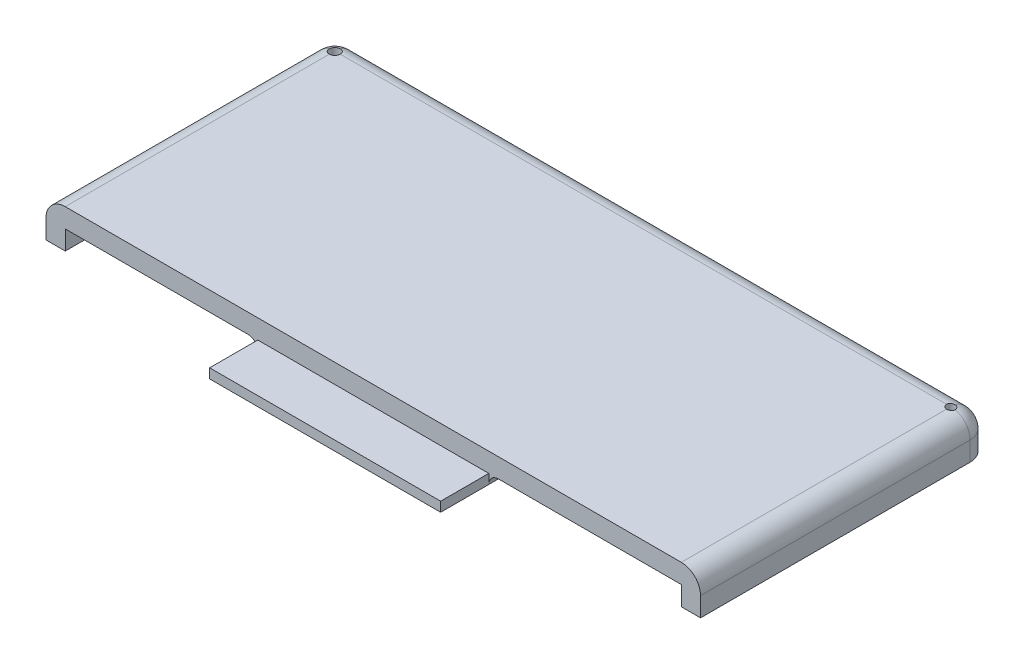
ISO-10303-21;
HEADER;
FILE_DESCRIPTION(('STEP AP214'),'2;1');
FILE_NAME('part.step','',(''),(''),'','','');
FILE_SCHEMA(('AUTOMOTIVE_DESIGN { 1 0 10303 214 1 1 1 1 }'));
ENDSEC;
DATA;
#1=APPLICATION_CONTEXT('core data for automotive mechanical design processes');
#2=APPLICATION_PROTOCOL_DEFINITION('international standard','automotive_design',2000,#1);
#3=PRODUCT_CONTEXT('',#1,'mechanical');
#4=PRODUCT('Part','Part','',(#3));
#5=PRODUCT_RELATED_PRODUCT_CATEGORY('part','',(#4));
#6=PRODUCT_DEFINITION_FORMATION('','',#4);
#7=PRODUCT_DEFINITION_CONTEXT('part definition',#1,'design');
#8=PRODUCT_DEFINITION('design','',#6,#7);
#9=PRODUCT_DEFINITION_SHAPE('','',#8);
#10=(LENGTH_UNIT() NAMED_UNIT(*) SI_UNIT(.MILLI.,.METRE.));
#11=(NAMED_UNIT(*) PLANE_ANGLE_UNIT() SI_UNIT($,.RADIAN.));
#12=(NAMED_UNIT(*) SI_UNIT($,.STERADIAN.) SOLID_ANGLE_UNIT());
#13=UNCERTAINTY_MEASURE_WITH_UNIT(LENGTH_MEASURE(1.E-05),#10,'distance_accuracy_value','');
#14=(GEOMETRIC_REPRESENTATION_CONTEXT(3) GLOBAL_UNCERTAINTY_ASSIGNED_CONTEXT((#13)) GLOBAL_UNIT_ASSIGNED_CONTEXT((#10,
#11,#12)) REPRESENTATION_CONTEXT('',''));
#15=CARTESIAN_POINT('',(0.,0.,0.));
#16=DIRECTION('',(0.,0.,1.));
#17=DIRECTION('',(1.,0.,0.));
#18=AXIS2_PLACEMENT_3D('',#15,#16,#17);
#19=CARTESIAN_POINT('',(85.,35.,75.));
#20=DIRECTION('',(0.,0.,-1.));
#21=DIRECTION('',(-1.,0.,0.));
#22=AXIS2_PLACEMENT_3D('',#19,#20,#21);
#23=PLANE('',#22);
#24=DIRECTION('',(-1.,0.,0.));
#25=VECTOR('',#24,1.);
#26=CARTESIAN_POINT('',(-30.,30.,75.));
#27=LINE('',#26,#25);
#28=CARTESIAN_POINT('',(30.,30.,75.));
#29=VERTEX_POINT('',#28);
#30=CARTESIAN_POINT('',(-30.,30.,75.));
#31=VERTEX_POINT('',#30);
#32=EDGE_CURVE('E220',#29,#31,#27,.T.);
#33=ORIENTED_EDGE('',*,*,#32,.F.);
#34=DIRECTION('',(0.,1.,0.));
#35=VECTOR('',#34,1.);
#36=CARTESIAN_POINT('',(30.,35.,75.));
#37=LINE('',#36,#35);
#38=CARTESIAN_POINT('',(30.,27.5,75.));
#39=VERTEX_POINT('',#38);
#40=EDGE_CURVE('E61',#39,#29,#37,.T.);
#41=ORIENTED_EDGE('',*,*,#40,.F.);
#42=CARTESIAN_POINT('',(32.5,27.5,75.));
#43=DIRECTION('',(0.,0.,-1.));
#44=DIRECTION('',(-1.,0.,0.));
#45=AXIS2_PLACEMENT_3D('',#42,#43,#44);
#46=CIRCLE('',#45,2.5);
#47=CARTESIAN_POINT('',(32.5,30.,75.));
#48=VERTEX_POINT('',#47);
#49=EDGE_CURVE('E11',#39,#48,#46,.T.);
#50=ORIENTED_EDGE('',*,*,#49,.T.);
#51=DIRECTION('',(-1.,0.,0.));
#52=VECTOR('',#51,1.);
#53=CARTESIAN_POINT('',(80.,30.,75.));
#54=LINE('',#53,#52);
#55=CARTESIAN_POINT('',(80.,30.,75.));
#56=VERTEX_POINT('',#55);
#57=EDGE_CURVE('E384',#56,#48,#54,.T.);
#58=ORIENTED_EDGE('',*,*,#57,.F.);
#59=DIRECTION('',(0.,-1.,0.));
#60=VECTOR('',#59,1.);
#61=CARTESIAN_POINT('',(80.,25.,75.));
#62=LINE('',#61,#60);
#63=CARTESIAN_POINT('',(80.,25.,75.));
#64=VERTEX_POINT('',#63);
#65=EDGE_CURVE('E403',#56,#64,#62,.T.);
#66=ORIENTED_EDGE('',*,*,#65,.T.);
#67=DIRECTION('',(-1.,0.,0.));
#68=VECTOR('',#67,1.);
#69=CARTESIAN_POINT('',(85.,25.,75.));
#70=LINE('',#69,#68);
#71=CARTESIAN_POINT('',(85.,25.,75.));
#72=VERTEX_POINT('',#71);
#73=EDGE_CURVE('E368',#72,#64,#70,.T.);
#74=ORIENTED_EDGE('',*,*,#73,.F.);
#75=DIRECTION('',(0.,-1.,0.));
#76=VECTOR('',#75,1.);
#77=CARTESIAN_POINT('',(85.,35.,75.));
#78=LINE('',#77,#76);
#79=CARTESIAN_POINT('',(85.,30.,75.));
#80=VERTEX_POINT('',#79);
#81=EDGE_CURVE('E375',#80,#72,#78,.T.);
#82=ORIENTED_EDGE('',*,*,#81,.F.);
#83=CARTESIAN_POINT('',(80.,30.,75.));
#84=DIRECTION('',(0.,0.,-1.));
#85=DIRECTION('',(-1.,0.,0.));
#86=AXIS2_PLACEMENT_3D('',#83,#84,#85);
#87=CIRCLE('',#86,5.);
#88=CARTESIAN_POINT('',(80.,35.,75.));
#89=VERTEX_POINT('',#88);
#90=EDGE_CURVE('E348',#80,#89,#87,.F.);
#91=ORIENTED_EDGE('',*,*,#90,.T.);
#92=DIRECTION('',(-1.,0.,0.));
#93=VECTOR('',#92,1.);
#94=CARTESIAN_POINT('',(85.,35.,75.));
#95=LINE('',#94,#93);
#96=CARTESIAN_POINT('',(-80.,35.,75.));
#97=VERTEX_POINT('',#96);
#98=EDGE_CURVE('E363',#89,#97,#95,.T.);
#99=ORIENTED_EDGE('',*,*,#98,.T.);
#100=CARTESIAN_POINT('',(-80.,30.,75.));
#101=DIRECTION('',(0.,0.,-1.));
#102=DIRECTION('',(-1.,0.,0.));
#103=AXIS2_PLACEMENT_3D('',#100,#101,#102);
#104=CIRCLE('',#103,5.);
#105=CARTESIAN_POINT('',(-85.,30.,75.));
#106=VERTEX_POINT('',#105);
#107=EDGE_CURVE('E360',#97,#106,#104,.F.);
#108=ORIENTED_EDGE('',*,*,#107,.T.);
#109=DIRECTION('',(0.,-1.,0.));
#110=VECTOR('',#109,1.);
#111=CARTESIAN_POINT('',(-85.,35.,75.));
#112=LINE('',#111,#110);
#113=CARTESIAN_POINT('',(-85.,25.,75.));
#114=VERTEX_POINT('',#113);
#115=EDGE_CURVE('E376',#106,#114,#112,.T.);
#116=ORIENTED_EDGE('',*,*,#115,.T.);
#117=CARTESIAN_POINT('',(-80.,25.,75.));
#118=VERTEX_POINT('',#117);
#119=EDGE_CURVE('E366',#118,#114,#70,.T.);
#120=ORIENTED_EDGE('',*,*,#119,.F.);
#121=DIRECTION('',(0.,-1.,0.));
#122=VECTOR('',#121,1.);
#123=CARTESIAN_POINT('',(-80.,25.,75.));
#124=LINE('',#123,#122);
#125=CARTESIAN_POINT('',(-80.,30.,75.));
#126=VERTEX_POINT('',#125);
#127=EDGE_CURVE('E396',#126,#118,#124,.T.);
#128=ORIENTED_EDGE('',*,*,#127,.F.);
#129=CARTESIAN_POINT('',(-32.5,30.,75.));
#130=VERTEX_POINT('',#129);
#131=EDGE_CURVE('E388',#130,#126,#54,.T.);
#132=ORIENTED_EDGE('',*,*,#131,.F.);
#133=CARTESIAN_POINT('',(-32.5,27.5,75.));
#134=DIRECTION('',(0.,0.,-1.));
#135=DIRECTION('',(-1.,0.,0.));
#136=AXIS2_PLACEMENT_3D('',#133,#134,#135);
#137=CIRCLE('',#136,2.5);
#138=CARTESIAN_POINT('',(-30.,27.5,75.));
#139=VERTEX_POINT('',#138);
#140=EDGE_CURVE('E48',#130,#139,#137,.T.);
#141=ORIENTED_EDGE('',*,*,#140,.T.);
#142=DIRECTION('',(0.,-1.,0.));
#143=VECTOR('',#142,1.);
#144=CARTESIAN_POINT('',(-30.,35.,75.));
#145=LINE('',#144,#143);
#146=EDGE_CURVE('E56',#31,#139,#145,.T.);
#147=ORIENTED_EDGE('',*,*,#146,.F.);
#148=EDGE_LOOP('',(#33,#41,#50,#58,#66,#74,#82,#91,#99,#108,#116,#120,#128,#132,#141,#147));
#149=FACE_BOUND('',#148,.T.);
#150=ADVANCED_FACE('F39',(#149),#23,.F.);
#151=CARTESIAN_POINT('',(80.,30.,4.99999999999996));
#152=DIRECTION('',(0.,1.,0.));
#153=DIRECTION('',(-1.,0.,0.));
#154=AXIS2_PLACEMENT_3D('',#151,#152,#153);
#155=PLANE('',#154);
#156=DIRECTION('',(1.,0.,0.));
#157=VECTOR('',#156,1.);
#158=CARTESIAN_POINT('',(-30.,30.,65.));
#159=LINE('',#158,#157);
#160=CARTESIAN_POINT('',(32.5,30.,65.));
#161=VERTEX_POINT('',#160);
#162=CARTESIAN_POINT('',(-32.5,30.,65.));
#163=VERTEX_POINT('',#162);
#164=EDGE_CURVE('E460',#161,#163,#159,.F.);
#165=ORIENTED_EDGE('',*,*,#164,.T.);
#166=DIRECTION('',(0.,0.,-1.));
#167=VECTOR('',#166,1.);
#168=CARTESIAN_POINT('',(-32.5,30.,75.));
#169=LINE('',#168,#167);
#170=EDGE_CURVE('E462',#163,#130,#169,.F.);
#171=ORIENTED_EDGE('',*,*,#170,.T.);
#172=ORIENTED_EDGE('',*,*,#131,.T.);
#173=DIRECTION('',(0.,0.,1.));
#174=VECTOR('',#173,1.);
#175=CARTESIAN_POINT('',(-80.,30.,4.99999999999996));
#176=LINE('',#175,#174);
#177=CARTESIAN_POINT('',(-80.,30.,9.99999999999997));
#178=VERTEX_POINT('',#177);
#179=EDGE_CURVE('E392',#178,#126,#176,.T.);
#180=ORIENTED_EDGE('',*,*,#179,.F.);
#181=CARTESIAN_POINT('',(-80.,30.,4.99999999999996));
#182=DIRECTION('',(0.,-1.,0.));
#183=DIRECTION('',(1.,0.,0.));
#184=AXIS2_PLACEMENT_3D('',#181,#182,#183);
#185=CIRCLE('',#184,5.);
#186=CARTESIAN_POINT('',(-75.,30.,4.99999999999996));
#187=VERTEX_POINT('',#186);
#188=EDGE_CURVE('E419',#187,#178,#185,.T.);
#189=ORIENTED_EDGE('',*,*,#188,.F.);
#190=DIRECTION('',(-1.,0.,0.));
#191=VECTOR('',#190,1.);
#192=CARTESIAN_POINT('',(80.,30.,4.99999999999996));
#193=LINE('',#192,#191);
#194=CARTESIAN_POINT('',(75.,30.,4.99999999999996));
#195=VERTEX_POINT('',#194);
#196=EDGE_CURVE('E379',#195,#187,#193,.T.);
#197=ORIENTED_EDGE('',*,*,#196,.F.);
#198=CARTESIAN_POINT('',(80.,30.,4.99999999999996));
#199=DIRECTION('',(0.,-1.,0.));
#200=DIRECTION('',(1.,0.,0.));
#201=AXIS2_PLACEMENT_3D('',#198,#199,#200);
#202=CIRCLE('',#201,4.99999999999999);
#203=CARTESIAN_POINT('',(80.,30.,9.99999999999995));
#204=VERTEX_POINT('',#203);
#205=EDGE_CURVE('E410',#204,#195,#202,.T.);
#206=ORIENTED_EDGE('',*,*,#205,.F.);
#207=DIRECTION('',(0.,0.,1.));
#208=VECTOR('',#207,1.);
#209=CARTESIAN_POINT('',(80.,30.,0.));
#210=LINE('',#209,#208);
#211=EDGE_CURVE('E401',#204,#56,#210,.T.);
#212=ORIENTED_EDGE('',*,*,#211,.T.);
#213=ORIENTED_EDGE('',*,*,#57,.T.);
#214=DIRECTION('',(0.,0.,1.));
#215=VECTOR('',#214,1.);
#216=CARTESIAN_POINT('',(32.5,30.,67.5));
#217=LINE('',#216,#215);
#218=EDGE_CURVE('E458',#48,#161,#217,.F.);
#219=ORIENTED_EDGE('',*,*,#218,.T.);
#220=EDGE_LOOP('',(#165,#171,#172,#180,#189,#197,#206,#212,#213,#219));
#221=FACE_BOUND('',#220,.T.);
#222=ADVANCED_FACE('F488',(#221),#155,.F.);
#223=CARTESIAN_POINT('',(85.,35.,90.));
#224=DIRECTION('',(-1.,0.,0.));
#225=DIRECTION('',(0.,-1.,0.));
#226=AXIS2_PLACEMENT_3D('',#223,#224,#225);
#227=PLANE('',#226);
#228=DIRECTION('',(0.,0.,-1.));
#229=VECTOR('',#228,1.);
#230=CARTESIAN_POINT('',(85.,25.,75.));
#231=LINE('',#230,#229);
#232=CARTESIAN_POINT('',(85.,25.,5.));
#233=VERTEX_POINT('',#232);
#234=EDGE_CURVE('E367',#72,#233,#231,.T.);
#235=ORIENTED_EDGE('',*,*,#234,.T.);
#236=DIRECTION('',(0.,1.,0.));
#237=VECTOR('',#236,1.);
#238=CARTESIAN_POINT('',(85.,35.,5.));
#239=LINE('',#238,#237);
#240=CARTESIAN_POINT('',(85.,30.,5.));
#241=VERTEX_POINT('',#240);
#242=EDGE_CURVE('E447',#233,#241,#239,.T.);
#243=ORIENTED_EDGE('',*,*,#242,.T.);
#244=DIRECTION('',(0.,0.,-1.));
#245=VECTOR('',#244,1.);
#246=CARTESIAN_POINT('',(85.,30.,90.));
#247=LINE('',#246,#245);
#248=EDGE_CURVE('E350',#241,#80,#247,.F.);
#249=ORIENTED_EDGE('',*,*,#248,.T.);
#250=ORIENTED_EDGE('',*,*,#81,.T.);
#251=EDGE_LOOP('',(#235,#243,#249,#250));
#252=FACE_BOUND('',#251,.T.);
#253=ADVANCED_FACE('F522',(#252),#227,.F.);
#254=CARTESIAN_POINT('',(-85.,35.,90.));
#255=DIRECTION('',(0.,-1.,0.));
#256=DIRECTION('',(0.,0.,-1.));
#257=AXIS2_PLACEMENT_3D('',#254,#255,#256);
#258=PLANE('',#257);
#259=CARTESIAN_POINT('',(80.,35.,4.99999999999996));
#260=DIRECTION('',(0.,-1.,0.));
#261=DIRECTION('',(1.,0.,0.));
#262=AXIS2_PLACEMENT_3D('',#259,#260,#261);
#263=CIRCLE('',#262,1.11584691689404);
#264=CARTESIAN_POINT('',(80.,35.,6.115846916894));
#265=VERTEX_POINT('',#264);
#266=CARTESIAN_POINT('',(78.884153083106,35.,5.));
#267=VERTEX_POINT('',#266);
#268=EDGE_CURVE('E248',#265,#267,#263,.T.);
#269=ORIENTED_EDGE('',*,*,#268,.T.);
#270=DIRECTION('',(-1.,0.,0.));
#271=VECTOR('',#270,1.);
#272=CARTESIAN_POINT('',(-85.,35.,5.));
#273=LINE('',#272,#271);
#274=CARTESIAN_POINT('',(-78.6,35.,5.));
#275=VERTEX_POINT('',#274);
#276=EDGE_CURVE('E337',#267,#275,#273,.T.);
#277=ORIENTED_EDGE('',*,*,#276,.T.);
#278=CARTESIAN_POINT('',(-80.,35.,4.99999999999996));
#279=DIRECTION('',(0.,-1.,0.));
#280=DIRECTION('',(1.,0.,0.));
#281=AXIS2_PLACEMENT_3D('',#278,#279,#280);
#282=CIRCLE('',#281,1.4);
#283=CARTESIAN_POINT('',(-80.,35.,6.39999999999997));
#284=VERTEX_POINT('',#283);
#285=EDGE_CURVE('E238',#275,#284,#282,.T.);
#286=ORIENTED_EDGE('',*,*,#285,.T.);
#287=DIRECTION('',(0.,0.,-1.));
#288=VECTOR('',#287,1.);
#289=CARTESIAN_POINT('',(-80.,35.,90.));
#290=LINE('',#289,#288);
#291=EDGE_CURVE('E352',#284,#97,#290,.F.);
#292=ORIENTED_EDGE('',*,*,#291,.T.);
#293=ORIENTED_EDGE('',*,*,#98,.F.);
#294=DIRECTION('',(0.,0.,-1.));
#295=VECTOR('',#294,1.);
#296=CARTESIAN_POINT('',(80.,35.,90.));
#297=LINE('',#296,#295);
#298=EDGE_CURVE('E354',#89,#265,#297,.T.);
#299=ORIENTED_EDGE('',*,*,#298,.T.);
#300=EDGE_LOOP('',(#269,#277,#286,#292,#293,#299));
#301=FACE_BOUND('',#300,.T.);
#302=ADVANCED_FACE('F505',(#301),#258,.F.);
#303=CARTESIAN_POINT('',(-85.,35.,90.));
#304=DIRECTION('',(1.,0.,0.));
#305=DIRECTION('',(0.,1.,0.));
#306=AXIS2_PLACEMENT_3D('',#303,#304,#305);
#307=PLANE('',#306);
#308=DIRECTION('',(0.,0.,-1.));
#309=VECTOR('',#308,1.);
#310=CARTESIAN_POINT('',(-85.,30.,90.));
#311=LINE('',#310,#309);
#312=CARTESIAN_POINT('',(-85.,30.,5.));
#313=VERTEX_POINT('',#312);
#314=EDGE_CURVE('E357',#106,#313,#311,.T.);
#315=ORIENTED_EDGE('',*,*,#314,.T.);
#316=DIRECTION('',(0.,-1.,0.));
#317=VECTOR('',#316,1.);
#318=CARTESIAN_POINT('',(-85.,35.,5.));
#319=LINE('',#318,#317);
#320=CARTESIAN_POINT('',(-85.,25.,5.));
#321=VERTEX_POINT('',#320);
#322=EDGE_CURVE('E444',#313,#321,#319,.T.);
#323=ORIENTED_EDGE('',*,*,#322,.T.);
#324=DIRECTION('',(0.,0.,-1.));
#325=VECTOR('',#324,1.);
#326=CARTESIAN_POINT('',(-85.,25.,75.));
#327=LINE('',#326,#325);
#328=EDGE_CURVE('E372',#114,#321,#327,.T.);
#329=ORIENTED_EDGE('',*,*,#328,.F.);
#330=ORIENTED_EDGE('',*,*,#115,.F.);
#331=EDGE_LOOP('',(#315,#323,#329,#330));
#332=FACE_BOUND('',#331,.T.);
#333=ADVANCED_FACE('F513',(#332),#307,.F.);
#334=CARTESIAN_POINT('',(0.,0.,0.));
#335=DIRECTION('',(0.,0.,1.));
#336=DIRECTION('',(1.,0.,0.));
#337=AXIS2_PLACEMENT_3D('',#334,#335,#336);
#338=PLANE('',#337);
#339=DIRECTION('',(-1.,0.,0.));
#340=VECTOR('',#339,1.);
#341=CARTESIAN_POINT('',(0.,30.,0.));
#342=LINE('',#341,#340);
#343=CARTESIAN_POINT('',(-80.,30.,0.));
#344=VERTEX_POINT('',#343);
#345=CARTESIAN_POINT('',(80.,30.,0.));
#346=VERTEX_POINT('',#345);
#347=EDGE_CURVE('E314',#344,#346,#342,.F.);
#348=ORIENTED_EDGE('',*,*,#347,.T.);
#349=DIRECTION('',(0.,1.,0.));
#350=VECTOR('',#349,1.);
#351=CARTESIAN_POINT('',(80.,0.,0.));
#352=LINE('',#351,#350);
#353=CARTESIAN_POINT('',(80.,25.,0.));
#354=VERTEX_POINT('',#353);
#355=EDGE_CURVE('E315',#346,#354,#352,.F.);
#356=ORIENTED_EDGE('',*,*,#355,.T.);
#357=DIRECTION('',(-1.,0.,0.));
#358=VECTOR('',#357,1.);
#359=CARTESIAN_POINT('',(85.,25.,0.));
#360=LINE('',#359,#358);
#361=CARTESIAN_POINT('',(-80.,25.,0.));
#362=VERTEX_POINT('',#361);
#363=EDGE_CURVE('E362',#354,#362,#360,.T.);
#364=ORIENTED_EDGE('',*,*,#363,.T.);
#365=DIRECTION('',(0.,-1.,0.));
#366=VECTOR('',#365,1.);
#367=CARTESIAN_POINT('',(-80.,0.,0.));
#368=LINE('',#367,#366);
#369=EDGE_CURVE('E310',#362,#344,#368,.F.);
#370=ORIENTED_EDGE('',*,*,#369,.T.);
#371=EDGE_LOOP('',(#348,#356,#364,#370));
#372=FACE_BOUND('',#371,.T.);
#373=ADVANCED_FACE('F515',(#372),#338,.F.);
#374=CARTESIAN_POINT('',(-80.,30.,90.));
#375=DIRECTION('',(0.,0.,-1.));
#376=DIRECTION('',(-1.,0.,0.));
#377=AXIS2_PLACEMENT_3D('',#374,#375,#376);
#378=CYLINDRICAL_SURFACE('',#377,5.);
#379=CARTESIAN_POINT('',(-80.,35.,3.59999999999996));
#380=CARTESIAN_POINT('',(-80.0385884907525,35.0000024412679,3.59999942047387));
#381=CARTESIAN_POINT('',(-80.0771577974381,34.9995527371201,3.60159645960424));
#382=CARTESIAN_POINT('',(-80.1540064974379,34.9977750593504,3.60796216519207));
#383=CARTESIAN_POINT('',(-80.1922859418487,34.9964472443463,3.61273025884581));
#384=CARTESIAN_POINT('',(-80.3061005859888,34.9911961352872,3.63171777435192));
#385=CARTESIAN_POINT('',(-80.3808512136656,34.9860048587764,3.65062077151146));
#386=CARTESIAN_POINT('',(-80.5259661256017,34.9727943815014,3.70028838251704));
#387=CARTESIAN_POINT('',(-80.5963310781524,34.9647756128377,3.73105118400135));
#388=CARTESIAN_POINT('',(-80.730931481933,34.9467517226607,3.80351293222535));
#389=CARTESIAN_POINT('',(-80.7951649251628,34.9367459537092,3.84521544495256));
#390=CARTESIAN_POINT('',(-80.9172640302432,34.9155425760352,3.93947642477926));
#391=CARTESIAN_POINT('',(-80.974952503018,34.9043231048786,3.99225939035546));
#392=CARTESIAN_POINT('',(-81.0807899406662,34.8820921228097,4.10670852005614));
#393=CARTESIAN_POINT('',(-81.1289369248317,34.8710806555051,4.16837652403756));
#394=CARTESIAN_POINT('',(-81.2152141622177,34.8502853308509,4.30029795507019));
#395=CARTESIAN_POINT('',(-81.2531345758586,34.8405290708117,4.37069336810933));
#396=CARTESIAN_POINT('',(-81.3165275144345,34.8236748152682,4.51717501041632));
#397=CARTESIAN_POINT('',(-81.3420032028512,34.816576144305,4.59325978775633));
#398=CARTESIAN_POINT('',(-81.3791581541336,34.8060680305973,4.74697904642611));
#399=CARTESIAN_POINT('',(-81.3911626278908,34.8025717996319,4.8245288392772));
#400=CARTESIAN_POINT('',(-81.4020490553807,34.7994055223262,4.98061610332217));
#401=CARTESIAN_POINT('',(-81.4009334477278,34.7997347649493,5.05915338826127));
#402=CARTESIAN_POINT('',(-81.3858679890032,34.8041049939835,5.2124040902424));
#403=CARTESIAN_POINT('',(-81.3723172098294,34.8080305599471,5.28716056164805));
#404=CARTESIAN_POINT('',(-81.3334075638177,34.8189655167221,5.43329307981969));
#405=CARTESIAN_POINT('',(-81.3080477865903,34.8259751452905,5.50466886549145));
#406=CARTESIAN_POINT('',(-81.2459268508621,34.8423863274716,5.64303076203277));
#407=CARTESIAN_POINT('',(-81.2090297563711,34.851816145652,5.70995234606216));
#408=CARTESIAN_POINT('',(-81.1249766892721,34.8719904090363,5.8367906554192));
#409=CARTESIAN_POINT('',(-81.0778186924826,34.8827351134461,5.89670599502531));
#410=CARTESIAN_POINT('',(-80.9725708156144,34.9048031917241,6.01010031402834));
#411=CARTESIAN_POINT('',(-80.9141483120011,34.9161334675687,6.06326965950771));
#412=CARTESIAN_POINT('',(-80.7890605090781,34.9377530605341,6.15913437920233));
#413=CARTESIAN_POINT('',(-80.7223931266795,34.9480421133887,6.20182709830816));
#414=CARTESIAN_POINT('',(-80.5821857001623,34.9664964150221,6.27568663846792));
#415=CARTESIAN_POINT('',(-80.5086086171869,34.9746492125669,6.30678631446441));
#416=CARTESIAN_POINT('',(-80.3570294716738,34.987813875874,6.35604502679302));
#417=CARTESIAN_POINT('',(-80.2790340593923,34.9928303321512,6.37422298140663));
#418=CARTESIAN_POINT('',(-80.1669450561484,34.9973234056671,6.39041594384621));
#419=CARTESIAN_POINT('',(-80.1336385047267,34.9983255187469,6.39401014903779));
#420=CARTESIAN_POINT('',(-80.0668934194733,34.9996636268001,6.39879971873887));
#421=CARTESIAN_POINT('',(-80.0334551803879,35.0000006802955,6.39999889526061));
#422=CARTESIAN_POINT('',(-80.,35.,6.39999999999999));
#423=B_SPLINE_CURVE_WITH_KNOTS('',3,(#379,#380,#381,#382,#383,#384,#385,#386,#387,#388,#389,
#390,#391,#392,#393,#394,#395,#396,#397,#398,#399,#400,#401,#402,#403,#404,#405,#406,#407,#408,
#409,#410,#411,#412,#413,#414,#415,#416,#417,#418,#419,#420,#421,#422),.UNSPECIFIED.,.F.,.F.,(4,
2,2,2,2,2,2,2,2,2,2,2,2,2,2,2,2,2,2,2,2,4),(0.,0.11569211235322,0.231363332325615,
0.461997817950236,0.692597073015805,0.923271589490383,1.15917102364552,1.39511937674161,
1.63559335316403,1.87600616861795,2.11048113951701,2.34491252951267,2.57207403461694,
2.79925305515183,3.02921659128418,3.25922553381963,3.49752067419178,3.7358761438861,
3.97559143725055,4.21495504416934,4.31542385566101,4.41573262959962),.UNSPECIFIED.);
#424=CARTESIAN_POINT('',(-81.4,34.8,5.));
#425=VERTEX_POINT('',#424);
#426=EDGE_CURVE('E260',#425,#284,#423,.T.);
#427=ORIENTED_EDGE('',*,*,#426,.F.);
#428=CARTESIAN_POINT('',(-80.,30.,5.));
#429=DIRECTION('',(0.,0.,-1.));
#430=DIRECTION('',(-1.,0.,0.));
#431=AXIS2_PLACEMENT_3D('',#428,#429,#430);
#432=CIRCLE('',#431,5.);
#433=EDGE_CURVE('E449',#425,#313,#432,.F.);
#434=ORIENTED_EDGE('',*,*,#433,.T.);
#435=ORIENTED_EDGE('',*,*,#314,.F.);
#436=ORIENTED_EDGE('',*,*,#107,.F.);
#437=ORIENTED_EDGE('',*,*,#291,.F.);
#438=EDGE_LOOP('',(#427,#434,#435,#436,#437));
#439=FACE_BOUND('',#438,.T.);
#440=ADVANCED_FACE('F511',(#439),#378,.T.);
#441=CARTESIAN_POINT('',(80.,30.,90.));
#442=DIRECTION('',(0.,0.,-1.));
#443=DIRECTION('',(-1.,0.,0.));
#444=AXIS2_PLACEMENT_3D('',#441,#442,#443);
#445=CYLINDRICAL_SURFACE('',#444,5.);
#446=ORIENTED_EDGE('',*,*,#248,.F.);
#447=CARTESIAN_POINT('',(80.,30.,5.));
#448=DIRECTION('',(0.,0.,-1.));
#449=DIRECTION('',(-1.,0.,0.));
#450=AXIS2_PLACEMENT_3D('',#447,#448,#449);
#451=CIRCLE('',#450,5.);
#452=CARTESIAN_POINT('',(81.1158469168941,34.8738984045688,5.00000000000001));
#453=VERTEX_POINT('',#452);
#454=EDGE_CURVE('E290',#241,#453,#451,.F.);
#455=ORIENTED_EDGE('',*,*,#454,.T.);
#456=CARTESIAN_POINT('',(80.,35.,6.115846916894));
#457=CARTESIAN_POINT('',(80.030984956712,35.0000015884586,6.11584714828423));
#458=CARTESIAN_POINT('',(80.0619547078634,34.999711624351,6.11455550462078));
#459=CARTESIAN_POINT('',(80.1236653458102,34.998565487047,6.10940550296128));
#460=CARTESIAN_POINT('',(80.1544062629041,34.9977093902075,6.10554749110271));
#461=CARTESIAN_POINT('',(80.2458445554333,34.9943229011776,6.09017517972278));
#462=CARTESIAN_POINT('',(80.3059179259297,34.9909741390187,6.07486239978159));
#463=CARTESIAN_POINT('',(80.4225620366924,34.9824564114646,6.0345864174574));
#464=CARTESIAN_POINT('',(80.4791325743701,34.9772873409063,6.00962265750782));
#465=CARTESIAN_POINT('',(80.5872999195411,34.9656861455854,5.95078013365243));
#466=CARTESIAN_POINT('',(80.6388959653112,34.9592538278435,5.91690000737382));
#467=CARTESIAN_POINT('',(80.7364815733369,34.9457114564347,5.84059674810388));
#468=CARTESIAN_POINT('',(80.7823767817419,34.938592776,5.79805451908261));
#469=CARTESIAN_POINT('',(80.8664474769859,34.924539513762,5.70588561660082));
#470=CARTESIAN_POINT('',(80.9046216193663,34.9176049642037,5.65625771188342));
#471=CARTESIAN_POINT('',(80.972583750469,34.9046198477515,5.55062168072333));
#472=CARTESIAN_POINT('',(81.0022699026986,34.8985804028629,5.49454654878604));
#473=CARTESIAN_POINT('',(81.0517587542308,34.8881946677877,5.37804937418077));
#474=CARTESIAN_POINT('',(81.0715632161778,34.8838480756693,5.31762810895499));
#475=CARTESIAN_POINT('',(81.1004133623333,34.8774283638701,5.19518390534608));
#476=CARTESIAN_POINT('',(81.109627658493,34.8753196564207,5.13320260133573));
#477=CARTESIAN_POINT('',(81.117560387888,34.8735076280137,5.00853932622873));
#478=CARTESIAN_POINT('',(81.1162799246005,34.873804054167,4.94585742948837));
#479=CARTESIAN_POINT('',(81.1033946222161,34.8767367006254,4.82283402277616));
#480=CARTESIAN_POINT('',(81.0919865902562,34.8793283166381,4.76247067436725));
#481=CARTESIAN_POINT('',(81.0594821753237,34.8864887079105,4.64453732014672));
#482=CARTESIAN_POINT('',(81.0383853065854,34.8910575823025,4.58696745455095));
#483=CARTESIAN_POINT('',(80.9869228317886,34.9017013206999,4.47570412075281));
#484=CARTESIAN_POINT('',(80.9564819910886,34.9077883307796,4.42204666129327));
#485=CARTESIAN_POINT('',(80.8872492966036,34.9207748877789,4.32053045567645));
#486=CARTESIAN_POINT('',(80.8484564973898,34.9276745266468,4.27267236695835));
#487=CARTESIAN_POINT('',(80.7625878642175,34.9416991526569,4.18298462799176));
#488=CARTESIAN_POINT('',(80.715345758455,34.9488257231163,4.14131427348457));
#489=CARTESIAN_POINT('',(80.6144478386652,34.9623623482747,4.06645070942874));
#490=CARTESIAN_POINT('',(80.5607903384324,34.9687722137363,4.03325973580066));
#491=CARTESIAN_POINT('',(80.4483780842937,34.9801764300808,3.97625376433829));
#492=CARTESIAN_POINT('',(80.38960933796,34.985166724649,3.95246556022847));
#493=CARTESIAN_POINT('',(80.2688088598797,34.9931340089567,3.91517826023497));
#494=CARTESIAN_POINT('',(80.2067820716674,34.9961139590761,3.9016640314275));
#495=CARTESIAN_POINT('',(80.1202012644788,34.9986128526402,3.89038276169861));
#496=CARTESIAN_POINT('',(80.0962025910995,34.9991324466942,3.88804595709143));
#497=CARTESIAN_POINT('',(80.0481396328636,34.9998257655033,3.88493300646773));
#498=CARTESIAN_POINT('',(80.0240755253429,35.0000000683802,3.8841542517837));
#499=CARTESIAN_POINT('',(80.,35.,3.88415308310592));
#500=B_SPLINE_CURVE_WITH_KNOTS('',3,(#456,#457,#458,#459,#460,#461,#462,#463,#464,#465,#466,
#467,#468,#469,#470,#471,#472,#473,#474,#475,#476,#477,#478,#479,#480,#481,#482,#483,#484,#485,
#486,#487,#488,#489,#490,#491,#492,#493,#494,#495,#496,#497,#498,#499),.UNSPECIFIED.,.F.,.F.,(4,
2,2,2,2,2,2,2,2,2,2,2,2,2,2,2,2,2,2,2,2,4),(0.,0.0928966087484948,0.185780690658574,
0.371073735146165,0.55637748617909,0.741709567083103,0.929786544797395,1.11789624395688,
1.30817625340558,1.49842230955197,1.68559545684352,1.87274892396506,2.05634319603775,
2.23994667391378,2.42506906838283,2.61021242945137,2.79950856126022,2.98885455699987,
3.17873628093628,3.3683377761565,3.4406495644279,3.51284017827167),.UNSPECIFIED.);
#501=EDGE_CURVE('E241',#265,#453,#500,.T.);
#502=ORIENTED_EDGE('',*,*,#501,.F.);
#503=ORIENTED_EDGE('',*,*,#298,.F.);
#504=ORIENTED_EDGE('',*,*,#90,.F.);
#505=EDGE_LOOP('',(#446,#455,#502,#503,#504));
#506=FACE_BOUND('',#505,.T.);
#507=ADVANCED_FACE('F268',(#506),#445,.T.);
#508=CARTESIAN_POINT('',(85.,25.,75.));
#509=DIRECTION('',(0.,1.,0.));
#510=DIRECTION('',(-1.,0.,0.));
#511=AXIS2_PLACEMENT_3D('',#508,#509,#510);
#512=PLANE('',#511);
#513=CARTESIAN_POINT('',(-80.,25.,4.99999999999996));
#514=DIRECTION('',(0.,-1.,0.));
#515=DIRECTION('',(1.,0.,0.));
#516=AXIS2_PLACEMENT_3D('',#513,#514,#515);
#517=CIRCLE('',#516,1.4);
#518=CARTESIAN_POINT('',(-78.6,25.,4.99999999999996));
#519=VERTEX_POINT('',#518);
#520=EDGE_CURVE('E242',#519,#519,#517,.T.);
#521=ORIENTED_EDGE('',*,*,#520,.F.);
#522=EDGE_LOOP('',(#521));
#523=FACE_BOUND('',#522,.T.);
#524=CARTESIAN_POINT('',(80.,25.,4.99999999999996));
#525=DIRECTION('',(0.,-1.,0.));
#526=DIRECTION('',(1.,0.,0.));
#527=AXIS2_PLACEMENT_3D('',#524,#525,#526);
#528=CIRCLE('',#527,1.11584691689404);
#529=CARTESIAN_POINT('',(81.1158469168941,25.,4.99999999999996));
#530=VERTEX_POINT('',#529);
#531=EDGE_CURVE('E245',#530,#530,#528,.T.);
#532=ORIENTED_EDGE('',*,*,#531,.F.);
#533=EDGE_LOOP('',(#532));
#534=FACE_BOUND('',#533,.T.);
#535=ORIENTED_EDGE('',*,*,#363,.F.);
#536=CARTESIAN_POINT('',(80.,25.,5.));
#537=DIRECTION('',(0.,1.,0.));
#538=DIRECTION('',(-1.,0.,0.));
#539=AXIS2_PLACEMENT_3D('',#536,#537,#538);
#540=CIRCLE('',#539,5.);
#541=EDGE_CURVE('E446',#354,#233,#540,.F.);
#542=ORIENTED_EDGE('',*,*,#541,.T.);
#543=ORIENTED_EDGE('',*,*,#234,.F.);
#544=ORIENTED_EDGE('',*,*,#73,.T.);
#545=DIRECTION('',(0.,0.,1.));
#546=VECTOR('',#545,1.);
#547=CARTESIAN_POINT('',(80.,25.,0.));
#548=LINE('',#547,#546);
#549=CARTESIAN_POINT('',(80.,25.,9.99999999999995));
#550=VERTEX_POINT('',#549);
#551=EDGE_CURVE('E400',#550,#64,#548,.T.);
#552=ORIENTED_EDGE('',*,*,#551,.F.);
#553=CARTESIAN_POINT('',(80.,25.,4.99999999999996));
#554=DIRECTION('',(0.,-1.,0.));
#555=DIRECTION('',(1.,0.,0.));
#556=AXIS2_PLACEMENT_3D('',#553,#554,#555);
#557=CIRCLE('',#556,4.99999999999999);
#558=CARTESIAN_POINT('',(75.,25.,4.99999999999996));
#559=VERTEX_POINT('',#558);
#560=EDGE_CURVE('E411',#550,#559,#557,.T.);
#561=ORIENTED_EDGE('',*,*,#560,.T.);
#562=DIRECTION('',(1.,0.,0.));
#563=VECTOR('',#562,1.);
#564=CARTESIAN_POINT('',(-78.9423491378348,25.,4.99999999999996));
#565=LINE('',#564,#563);
#566=CARTESIAN_POINT('',(-75.,25.,4.99999999999996));
#567=VERTEX_POINT('',#566);
#568=EDGE_CURVE('E387',#567,#559,#565,.T.);
#569=ORIENTED_EDGE('',*,*,#568,.F.);
#570=CARTESIAN_POINT('',(-80.,25.,4.99999999999996));
#571=DIRECTION('',(0.,-1.,0.));
#572=DIRECTION('',(1.,0.,0.));
#573=AXIS2_PLACEMENT_3D('',#570,#571,#572);
#574=CIRCLE('',#573,5.);
#575=CARTESIAN_POINT('',(-80.,25.,9.99999999999997));
#576=VERTEX_POINT('',#575);
#577=EDGE_CURVE('E418',#567,#576,#574,.T.);
#578=ORIENTED_EDGE('',*,*,#577,.T.);
#579=DIRECTION('',(0.,0.,1.));
#580=VECTOR('',#579,1.);
#581=CARTESIAN_POINT('',(-80.,25.,4.99999999999996));
#582=LINE('',#581,#580);
#583=EDGE_CURVE('E395',#576,#118,#582,.T.);
#584=ORIENTED_EDGE('',*,*,#583,.T.);
#585=ORIENTED_EDGE('',*,*,#119,.T.);
#586=ORIENTED_EDGE('',*,*,#328,.T.);
#587=CARTESIAN_POINT('',(-80.,25.,5.));
#588=DIRECTION('',(0.,1.,0.));
#589=DIRECTION('',(-1.,0.,0.));
#590=AXIS2_PLACEMENT_3D('',#587,#588,#589);
#591=CIRCLE('',#590,5.);
#592=EDGE_CURVE('E437',#321,#362,#591,.F.);
#593=ORIENTED_EDGE('',*,*,#592,.T.);
#594=EDGE_LOOP('',(#535,#542,#543,#544,#552,#561,#569,#578,#584,#585,#586,#593));
#595=FACE_BOUND('',#594,.T.);
#596=ADVANCED_FACE('F423',(#523,#534,#595),#512,.F.);
#597=CARTESIAN_POINT('',(0.,0.,4.99999999999996));
#598=DIRECTION('',(0.,0.,1.));
#599=DIRECTION('',(1.,0.,0.));
#600=AXIS2_PLACEMENT_3D('',#597,#598,#599);
#601=PLANE('',#600);
#602=DIRECTION('',(0.,-1.,0.));
#603=VECTOR('',#602,1.);
#604=CARTESIAN_POINT('',(-75.,30.,4.99999999999996));
#605=LINE('',#604,#603);
#606=EDGE_CURVE('E414',#567,#187,#605,.F.);
#607=ORIENTED_EDGE('',*,*,#606,.F.);
#608=ORIENTED_EDGE('',*,*,#568,.T.);
#609=DIRECTION('',(0.,-1.,0.));
#610=VECTOR('',#609,1.);
#611=CARTESIAN_POINT('',(75.,30.,4.99999999999996));
#612=LINE('',#611,#610);
#613=EDGE_CURVE('E407',#195,#559,#612,.T.);
#614=ORIENTED_EDGE('',*,*,#613,.F.);
#615=ORIENTED_EDGE('',*,*,#196,.T.);
#616=EDGE_LOOP('',(#607,#608,#614,#615));
#617=FACE_BOUND('',#616,.T.);
#618=ADVANCED_FACE('F532',(#617),#601,.T.);
#619=CARTESIAN_POINT('',(-80.,25.,4.99999999999996));
#620=DIRECTION('',(-1.,0.,0.));
#621=DIRECTION('',(0.,0.,1.));
#622=AXIS2_PLACEMENT_3D('',#619,#620,#621);
#623=PLANE('',#622);
#624=ORIENTED_EDGE('',*,*,#583,.F.);
#625=DIRECTION('',(0.,-1.,0.));
#626=VECTOR('',#625,1.);
#627=CARTESIAN_POINT('',(-80.,30.,9.99999999999997));
#628=LINE('',#627,#626);
#629=EDGE_CURVE('E341',#576,#178,#628,.F.);
#630=ORIENTED_EDGE('',*,*,#629,.T.);
#631=ORIENTED_EDGE('',*,*,#179,.T.);
#632=ORIENTED_EDGE('',*,*,#127,.T.);
#633=EDGE_LOOP('',(#624,#630,#631,#632));
#634=FACE_BOUND('',#633,.T.);
#635=ADVANCED_FACE('F430',(#634),#623,.F.);
#636=CARTESIAN_POINT('',(80.,25.,0.));
#637=DIRECTION('',(-1.,0.,0.));
#638=DIRECTION('',(0.,0.,1.));
#639=AXIS2_PLACEMENT_3D('',#636,#637,#638);
#640=PLANE('',#639);
#641=DIRECTION('',(0.,-1.,0.));
#642=VECTOR('',#641,1.);
#643=CARTESIAN_POINT('',(80.,30.,9.99999999999995));
#644=LINE('',#643,#642);
#645=EDGE_CURVE('E343',#550,#204,#644,.F.);
#646=ORIENTED_EDGE('',*,*,#645,.F.);
#647=ORIENTED_EDGE('',*,*,#551,.T.);
#648=ORIENTED_EDGE('',*,*,#65,.F.);
#649=ORIENTED_EDGE('',*,*,#211,.F.);
#650=EDGE_LOOP('',(#646,#647,#648,#649));
#651=FACE_BOUND('',#650,.T.);
#652=ADVANCED_FACE('F493',(#651),#640,.T.);
#653=CARTESIAN_POINT('',(80.,30.,4.99999999999996));
#654=DIRECTION('',(0.,-1.,0.));
#655=DIRECTION('',(1.,0.,0.));
#656=AXIS2_PLACEMENT_3D('',#653,#654,#655);
#657=CYLINDRICAL_SURFACE('',#656,4.99999999999999);
#658=ORIENTED_EDGE('',*,*,#205,.T.);
#659=ORIENTED_EDGE('',*,*,#613,.T.);
#660=ORIENTED_EDGE('',*,*,#560,.F.);
#661=ORIENTED_EDGE('',*,*,#645,.T.);
#662=EDGE_LOOP('',(#658,#659,#660,#661));
#663=FACE_BOUND('',#662,.T.);
#664=ADVANCED_FACE('F496',(#663),#657,.T.);
#665=CARTESIAN_POINT('',(-80.,30.,4.99999999999996));
#666=DIRECTION('',(0.,-1.,0.));
#667=DIRECTION('',(1.,0.,0.));
#668=AXIS2_PLACEMENT_3D('',#665,#666,#667);
#669=CYLINDRICAL_SURFACE('',#668,5.);
#670=ORIENTED_EDGE('',*,*,#577,.F.);
#671=ORIENTED_EDGE('',*,*,#606,.T.);
#672=ORIENTED_EDGE('',*,*,#188,.T.);
#673=ORIENTED_EDGE('',*,*,#629,.F.);
#674=EDGE_LOOP('',(#670,#671,#672,#673));
#675=FACE_BOUND('',#674,.T.);
#676=ADVANCED_FACE('F276',(#675),#669,.T.);
#677=CARTESIAN_POINT('',(80.,35.,4.99999999999996));
#678=DIRECTION('',(0.,-1.,0.));
#679=DIRECTION('',(1.,0.,0.));
#680=AXIS2_PLACEMENT_3D('',#677,#678,#679);
#681=CYLINDRICAL_SURFACE('',#680,1.11584691689404);
#682=CARTESIAN_POINT('',(80.,34.8738984045688,4.99999999999996));
#683=DIRECTION('',(0.,-1.,0.));
#684=DIRECTION('',(1.,0.,0.));
#685=AXIS2_PLACEMENT_3D('',#682,#683,#684);
#686=CIRCLE('',#685,1.11584691689404);
#687=CARTESIAN_POINT('',(80.,34.8738984045688,3.88415308310593));
#688=VERTEX_POINT('',#687);
#689=EDGE_CURVE('E291',#453,#688,#686,.F.);
#690=ORIENTED_EDGE('',*,*,#689,.T.);
#691=CARTESIAN_POINT('',(80.,34.8738984045688,3.88415308310592));
#692=CARTESIAN_POINT('',(79.9690238207288,34.8738965924286,3.88415282568167));
#693=CARTESIAN_POINT('',(79.9380628789767,34.874194085042,3.88544376225517));
#694=CARTESIAN_POINT('',(79.8763704365384,34.8753688605028,3.89059077641788));
#695=CARTESIAN_POINT('',(79.8456389036655,34.8762460604087,3.89444648705325));
#696=CARTESIAN_POINT('',(79.7542362560127,34.8797129568876,3.90980811339104));
#697=CARTESIAN_POINT('',(79.6941898236056,34.8831381487719,3.9251087403493));
#698=CARTESIAN_POINT('',(79.5775997803732,34.8918213402576,3.96534936924262));
#699=CARTESIAN_POINT('',(79.5210563059032,34.8970794111524,3.99028974613908));
#700=CARTESIAN_POINT('',(79.4129323369639,34.9088332360718,4.04907842872096));
#701=CARTESIAN_POINT('',(79.361352856737,34.9153292422263,4.08292854958885));
#702=CARTESIAN_POINT('',(79.2637482279484,34.9289528008772,4.1592002121615));
#703=CARTESIAN_POINT('',(79.2178225065,34.9360886382182,4.20174746848629));
#704=CARTESIAN_POINT('',(79.1336909438636,34.9501164243015,4.29394223661482));
#705=CARTESIAN_POINT('',(79.095486560935,34.9570083267716,4.34359108661445));
#706=CARTESIAN_POINT('',(79.0274827270772,34.969863622797,4.44925789504364));
#707=CARTESIAN_POINT('',(78.9977824449027,34.9758157243311,4.50534109638453));
#708=CARTESIAN_POINT('',(78.9482819681112,34.9860211568656,4.62184392835286));
#709=CARTESIAN_POINT('',(78.9284745256859,34.9902757310674,4.68226034710584));
#710=CARTESIAN_POINT('',(78.9040496082727,34.99558798317,4.78584163814324));
#711=CARTESIAN_POINT('',(78.8965983869221,34.9972332330052,4.82832975135342));
#712=CARTESIAN_POINT('',(78.8866478731834,34.9994432020494,4.91387145414226));
#713=CARTESIAN_POINT('',(78.8841442749635,35.0000088607933,4.95692451917081));
#714=CARTESIAN_POINT('',(78.884153083106,35.,5.00000000000001));
#715=B_SPLINE_CURVE_WITH_KNOTS('',3,(#691,#692,#693,#694,#695,#696,#697,#698,#699,#700,#701,
#702,#703,#704,#705,#706,#707,#708,#709,#710,#711,#712,#713,#714),.UNSPECIFIED.,.F.,.F.,(4,2,2,
2,2,2,2,2,2,2,2,4),(0.,0.0928701850263266,0.185727085551284,0.370945597745854,0.556171315187969,
0.741434797920199,0.929594264316295,1.11778923355379,1.30809688671197,1.49826490917164,
1.62748505381557,1.75659269076172),.UNSPECIFIED.);
#716=EDGE_CURVE('E283',#688,#267,#715,.T.);
#717=ORIENTED_EDGE('',*,*,#716,.T.);
#718=ORIENTED_EDGE('',*,*,#268,.F.);
#719=ORIENTED_EDGE('',*,*,#501,.T.);
#720=EDGE_LOOP('',(#690,#717,#718,#719));
#721=FACE_BOUND('',#720,.T.);
#722=ORIENTED_EDGE('',*,*,#531,.T.);
#723=EDGE_LOOP('',(#722));
#724=FACE_BOUND('',#723,.T.);
#725=ADVANCED_FACE('F271',(#721,#724),#681,.F.);
#726=CARTESIAN_POINT('',(-80.,35.,4.99999999999996));
#727=DIRECTION('',(0.,-1.,0.));
#728=DIRECTION('',(1.,0.,0.));
#729=AXIS2_PLACEMENT_3D('',#726,#727,#728);
#730=CYLINDRICAL_SURFACE('',#729,1.4);
#731=ORIENTED_EDGE('',*,*,#285,.F.);
#732=CARTESIAN_POINT('',(-78.6,35.,5.));
#733=CARTESIAN_POINT('',(-78.5999994205373,35.0000024419028,4.96141023320573));
#734=CARTESIAN_POINT('',(-78.6015965654442,34.999552707625,4.92283965023802));
#735=CARTESIAN_POINT('',(-78.6079626909834,34.9977749125455,4.84598843043636));
#736=CARTESIAN_POINT('',(-78.6127310984003,34.9964470104755,4.80770774246748));
#737=CARTESIAN_POINT('',(-78.6317190265348,34.9911957927348,4.69389445965467));
#738=CARTESIAN_POINT('',(-78.6506216025552,34.9860046398794,4.6191463823371));
#739=CARTESIAN_POINT('',(-78.7002879969182,34.9727944819202,4.47403497693323));
#740=CARTESIAN_POINT('',(-78.7310502157396,34.9647758581726,4.40367105903711));
#741=CARTESIAN_POINT('',(-78.8035117067973,34.9467520232553,4.26907045580179));
#742=CARTESIAN_POINT('',(-78.8452148747633,34.9367461047812,4.20483596409181));
#743=CARTESIAN_POINT('',(-78.9394754639447,34.9155427688409,4.0827370602759));
#744=CARTESIAN_POINT('',(-78.9922570477165,34.9043235212039,4.02504958247015));
#745=CARTESIAN_POINT('',(-79.1067068867155,34.8820924793757,3.91921165068468));
#746=CARTESIAN_POINT('',(-79.1683772894469,34.8710807360456,3.8710635080656));
#747=CARTESIAN_POINT('',(-79.3003170296091,34.8502821189365,3.78477241127703));
#748=CARTESIAN_POINT('',(-79.3707304998589,34.8405232916313,3.74684268202016));
#749=CARTESIAN_POINT('',(-79.5172306524485,34.8236699166958,3.68345507457368));
#750=CARTESIAN_POINT('',(-79.5933122587916,34.8165730187964,3.6579861883871));
#751=CARTESIAN_POINT('',(-79.724816421952,34.8075827293767,3.62619726434112));
#752=CARTESIAN_POINT('',(-79.7793576534668,34.8047590539511,3.61639194642027));
#753=CARTESIAN_POINT('',(-79.8892552595627,34.8009589013499,3.60328746208997));
#754=CARTESIAN_POINT('',(-79.9446112887673,34.7999816630084,3.59998561469921));
#755=CARTESIAN_POINT('',(-80.,34.8,3.59999999999996));
#756=B_SPLINE_CURVE_WITH_KNOTS('',3,(#732,#733,#734,#735,#736,#737,#738,#739,#740,#741,#742,
#743,#744,#745,#746,#747,#748,#749,#750,#751,#752,#753,#754,#755),.UNSPECIFIED.,.F.,.F.,(4,2,2,
2,2,2,2,2,2,2,2,4),(0.,0.115695937520819,0.23137096832915,0.461997838401112,0.6925936144834,
0.923271610208031,1.15916696019398,1.39511939740863,1.63566924156598,1.87600619685637,
2.04207334617785,2.20807202187688),.UNSPECIFIED.);
#757=CARTESIAN_POINT('',(-80.,34.8,3.59999999999996));
#758=VERTEX_POINT('',#757);
#759=EDGE_CURVE('E303',#275,#758,#756,.T.);
#760=ORIENTED_EDGE('',*,*,#759,.T.);
#761=CARTESIAN_POINT('',(-80.,34.8,4.99999999999996));
#762=DIRECTION('',(0.,-1.,0.));
#763=DIRECTION('',(1.,0.,0.));
#764=AXIS2_PLACEMENT_3D('',#761,#762,#763);
#765=CIRCLE('',#764,1.4);
#766=EDGE_CURVE('E311',#758,#425,#765,.F.);
#767=ORIENTED_EDGE('',*,*,#766,.T.);
#768=ORIENTED_EDGE('',*,*,#426,.T.);
#769=EDGE_LOOP('',(#731,#760,#767,#768));
#770=FACE_BOUND('',#769,.T.);
#771=ORIENTED_EDGE('',*,*,#520,.T.);
#772=EDGE_LOOP('',(#771));
#773=FACE_BOUND('',#772,.T.);
#774=ADVANCED_FACE('F275',(#770,#773),#730,.F.);
#775=CARTESIAN_POINT('',(80.,35.,5.));
#776=DIRECTION('',(0.,1.,0.));
#777=DIRECTION('',(-1.,0.,0.));
#778=AXIS2_PLACEMENT_3D('',#775,#776,#777);
#779=CYLINDRICAL_SURFACE('',#778,5.);
#780=ORIENTED_EDGE('',*,*,#541,.F.);
#781=ORIENTED_EDGE('',*,*,#355,.F.);
#782=CARTESIAN_POINT('',(80.,30.,5.));
#783=DIRECTION('',(0.,1.,0.));
#784=DIRECTION('',(-1.,0.,0.));
#785=AXIS2_PLACEMENT_3D('',#782,#783,#784);
#786=CIRCLE('',#785,5.);
#787=EDGE_CURVE('E251',#241,#346,#786,.T.);
#788=ORIENTED_EDGE('',*,*,#787,.F.);
#789=ORIENTED_EDGE('',*,*,#242,.F.);
#790=EDGE_LOOP('',(#780,#781,#788,#789));
#791=FACE_BOUND('',#790,.T.);
#792=ADVANCED_FACE('F559',(#791),#779,.T.);
#793=CARTESIAN_POINT('',(-80.,35.,5.));
#794=DIRECTION('',(0.,-1.,0.));
#795=DIRECTION('',(1.,0.,0.));
#796=AXIS2_PLACEMENT_3D('',#793,#794,#795);
#797=CYLINDRICAL_SURFACE('',#796,5.);
#798=ORIENTED_EDGE('',*,*,#592,.F.);
#799=ORIENTED_EDGE('',*,*,#322,.F.);
#800=CARTESIAN_POINT('',(-80.,30.,5.));
#801=DIRECTION('',(0.,1.,0.));
#802=DIRECTION('',(0.,0.,1.));
#803=AXIS2_PLACEMENT_3D('',#800,#801,#802);
#804=CIRCLE('',#803,5.);
#805=EDGE_CURVE('E333',#344,#313,#804,.T.);
#806=ORIENTED_EDGE('',*,*,#805,.F.);
#807=ORIENTED_EDGE('',*,*,#369,.F.);
#808=EDGE_LOOP('',(#798,#799,#806,#807));
#809=FACE_BOUND('',#808,.T.);
#810=ADVANCED_FACE('F442',(#809),#797,.T.);
#811=CARTESIAN_POINT('',(80.,30.,5.));
#812=DIRECTION('',(0.,0.,1.));
#813=DIRECTION('',(1.,0.,0.));
#814=AXIS2_PLACEMENT_3D('',#811,#812,#813);
#815=SPHERICAL_SURFACE('',#814,5.);
#816=ORIENTED_EDGE('',*,*,#454,.F.);
#817=ORIENTED_EDGE('',*,*,#787,.T.);
#818=CARTESIAN_POINT('',(80.,30.,5.));
#819=DIRECTION('',(-1.,0.,0.));
#820=DIRECTION('',(0.,0.,1.));
#821=AXIS2_PLACEMENT_3D('',#818,#819,#820);
#822=CIRCLE('',#821,5.);
#823=EDGE_CURVE('E329',#688,#346,#822,.T.);
#824=ORIENTED_EDGE('',*,*,#823,.F.);
#825=ORIENTED_EDGE('',*,*,#689,.F.);
#826=EDGE_LOOP('',(#816,#817,#824,#825));
#827=FACE_BOUND('',#826,.T.);
#828=ADVANCED_FACE('F330',(#827),#815,.T.);
#829=CARTESIAN_POINT('',(-80.,30.,5.));
#830=DIRECTION('',(0.,0.,1.));
#831=DIRECTION('',(1.,0.,0.));
#832=AXIS2_PLACEMENT_3D('',#829,#830,#831);
#833=SPHERICAL_SURFACE('',#832,5.);
#834=ORIENTED_EDGE('',*,*,#433,.F.);
#835=ORIENTED_EDGE('',*,*,#766,.F.);
#836=CARTESIAN_POINT('',(-80.,30.,5.));
#837=DIRECTION('',(-1.,0.,0.));
#838=DIRECTION('',(0.,0.,1.));
#839=AXIS2_PLACEMENT_3D('',#836,#837,#838);
#840=CIRCLE('',#839,5.);
#841=EDGE_CURVE('E237',#344,#758,#840,.F.);
#842=ORIENTED_EDGE('',*,*,#841,.F.);
#843=ORIENTED_EDGE('',*,*,#805,.T.);
#844=EDGE_LOOP('',(#834,#835,#842,#843));
#845=FACE_BOUND('',#844,.T.);
#846=ADVANCED_FACE('F298',(#845),#833,.T.);
#847=CARTESIAN_POINT('',(-85.,30.,5.));
#848=DIRECTION('',(-1.,0.,0.));
#849=DIRECTION('',(0.,0.,1.));
#850=AXIS2_PLACEMENT_3D('',#847,#848,#849);
#851=CYLINDRICAL_SURFACE('',#850,5.);
#852=ORIENTED_EDGE('',*,*,#823,.T.);
#853=ORIENTED_EDGE('',*,*,#347,.F.);
#854=ORIENTED_EDGE('',*,*,#841,.T.);
#855=ORIENTED_EDGE('',*,*,#759,.F.);
#856=ORIENTED_EDGE('',*,*,#276,.F.);
#857=ORIENTED_EDGE('',*,*,#716,.F.);
#858=EDGE_LOOP('',(#852,#853,#854,#855,#856,#857));
#859=FACE_BOUND('',#858,.T.);
#860=ADVANCED_FACE('F294',(#859),#851,.T.);
#861=CARTESIAN_POINT('',(-30.,27.5,67.5));
#862=DIRECTION('',(1.,0.,0.));
#863=DIRECTION('',(0.,1.,0.));
#864=AXIS2_PLACEMENT_3D('',#861,#862,#863);
#865=PLANE('',#864);
#866=DIRECTION('',(0.,0.,-1.));
#867=VECTOR('',#866,1.);
#868=CARTESIAN_POINT('',(-30.,30.,87.5));
#869=LINE('',#868,#867);
#870=CARTESIAN_POINT('',(-30.,30.,87.5));
#871=VERTEX_POINT('',#870);
#872=EDGE_CURVE('E203',#871,#31,#869,.T.);
#873=ORIENTED_EDGE('',*,*,#872,.T.);
#874=ORIENTED_EDGE('',*,*,#146,.T.);
#875=DIRECTION('',(0.,0.,-1.));
#876=VECTOR('',#875,1.);
#877=CARTESIAN_POINT('',(-30.,27.5,67.5));
#878=LINE('',#877,#876);
#879=CARTESIAN_POINT('',(-30.,27.5,87.5));
#880=VERTEX_POINT('',#879);
#881=EDGE_CURVE('E206',#880,#139,#878,.T.);
#882=ORIENTED_EDGE('',*,*,#881,.F.);
#883=DIRECTION('',(0.,-1.,0.));
#884=VECTOR('',#883,1.);
#885=CARTESIAN_POINT('',(-30.,27.5,87.5));
#886=LINE('',#885,#884);
#887=EDGE_CURVE('E199',#871,#880,#886,.T.);
#888=ORIENTED_EDGE('',*,*,#887,.F.);
#889=EDGE_LOOP('',(#873,#874,#882,#888));
#890=FACE_BOUND('',#889,.T.);
#891=ADVANCED_FACE('F201',(#890),#865,.F.);
#892=CARTESIAN_POINT('',(30.,27.5,75.));
#893=DIRECTION('',(-1.,0.,0.));
#894=DIRECTION('',(0.,-1.,0.));
#895=AXIS2_PLACEMENT_3D('',#892,#893,#894);
#896=PLANE('',#895);
#897=DIRECTION('',(0.,0.,1.));
#898=VECTOR('',#897,1.);
#899=CARTESIAN_POINT('',(30.,27.5,75.));
#900=LINE('',#899,#898);
#901=CARTESIAN_POINT('',(30.,27.5,87.5));
#902=VERTEX_POINT('',#901);
#903=EDGE_CURVE('E233',#39,#902,#900,.T.);
#904=ORIENTED_EDGE('',*,*,#903,.F.);
#905=ORIENTED_EDGE('',*,*,#40,.T.);
#906=DIRECTION('',(0.,0.,-1.));
#907=VECTOR('',#906,1.);
#908=CARTESIAN_POINT('',(30.,30.,87.5));
#909=LINE('',#908,#907);
#910=CARTESIAN_POINT('',(30.,30.,87.5));
#911=VERTEX_POINT('',#910);
#912=EDGE_CURVE('E224',#911,#29,#909,.T.);
#913=ORIENTED_EDGE('',*,*,#912,.F.);
#914=DIRECTION('',(0.,1.,0.));
#915=VECTOR('',#914,1.);
#916=CARTESIAN_POINT('',(30.,30.,87.5));
#917=LINE('',#916,#915);
#918=EDGE_CURVE('E216',#902,#911,#917,.T.);
#919=ORIENTED_EDGE('',*,*,#918,.F.);
#920=EDGE_LOOP('',(#904,#905,#913,#919));
#921=FACE_BOUND('',#920,.T.);
#922=ADVANCED_FACE('F479',(#921),#896,.F.);
#923=CARTESIAN_POINT('',(0.,27.5,0.));
#924=DIRECTION('',(0.,1.,0.));
#925=DIRECTION('',(-1.,0.,0.));
#926=AXIS2_PLACEMENT_3D('',#923,#924,#925);
#927=PLANE('',#926);
#928=CARTESIAN_POINT('',(30.,27.5,67.5));
#929=VERTEX_POINT('',#928);
#930=EDGE_CURVE('E234',#929,#39,#900,.T.);
#931=ORIENTED_EDGE('',*,*,#930,.T.);
#932=ORIENTED_EDGE('',*,*,#903,.T.);
#933=DIRECTION('',(1.,0.,0.));
#934=VECTOR('',#933,1.);
#935=CARTESIAN_POINT('',(30.,27.5,87.5));
#936=LINE('',#935,#934);
#937=EDGE_CURVE('E210',#880,#902,#936,.T.);
#938=ORIENTED_EDGE('',*,*,#937,.F.);
#939=ORIENTED_EDGE('',*,*,#881,.T.);
#940=CARTESIAN_POINT('',(-30.,27.5,67.5));
#941=VERTEX_POINT('',#940);
#942=EDGE_CURVE('E223',#139,#941,#878,.T.);
#943=ORIENTED_EDGE('',*,*,#942,.T.);
#944=DIRECTION('',(1.,0.,0.));
#945=VECTOR('',#944,1.);
#946=CARTESIAN_POINT('',(30.,27.5,67.5));
#947=LINE('',#946,#945);
#948=EDGE_CURVE('E231',#941,#929,#947,.T.);
#949=ORIENTED_EDGE('',*,*,#948,.T.);
#950=EDGE_LOOP('',(#931,#932,#938,#939,#943,#949));
#951=FACE_BOUND('',#950,.T.);
#952=ADVANCED_FACE('F482',(#951),#927,.F.);
#953=CARTESIAN_POINT('',(-30.,30.,87.5));
#954=DIRECTION('',(0.,-1.,0.));
#955=DIRECTION('',(1.,0.,0.));
#956=AXIS2_PLACEMENT_3D('',#953,#954,#955);
#957=PLANE('',#956);
#958=ORIENTED_EDGE('',*,*,#32,.T.);
#959=ORIENTED_EDGE('',*,*,#872,.F.);
#960=DIRECTION('',(-1.,0.,0.));
#961=VECTOR('',#960,1.);
#962=CARTESIAN_POINT('',(-30.,30.,87.5));
#963=LINE('',#962,#961);
#964=EDGE_CURVE('E211',#911,#871,#963,.T.);
#965=ORIENTED_EDGE('',*,*,#964,.F.);
#966=ORIENTED_EDGE('',*,*,#912,.T.);
#967=EDGE_LOOP('',(#958,#959,#965,#966));
#968=FACE_BOUND('',#967,.T.);
#969=ADVANCED_FACE('F222',(#968),#957,.F.);
#970=CARTESIAN_POINT('',(0.,0.,87.5));
#971=DIRECTION('',(0.,0.,-1.));
#972=DIRECTION('',(-1.,0.,0.));
#973=AXIS2_PLACEMENT_3D('',#970,#971,#972);
#974=PLANE('',#973);
#975=ORIENTED_EDGE('',*,*,#964,.T.);
#976=ORIENTED_EDGE('',*,*,#887,.T.);
#977=ORIENTED_EDGE('',*,*,#937,.T.);
#978=ORIENTED_EDGE('',*,*,#918,.T.);
#979=EDGE_LOOP('',(#975,#976,#977,#978));
#980=FACE_BOUND('',#979,.T.);
#981=ADVANCED_FACE('F214',(#980),#974,.F.);
#982=CARTESIAN_POINT('',(32.5,27.5,75.));
#983=DIRECTION('',(0.,0.,-1.));
#984=DIRECTION('',(-1.,0.,0.));
#985=AXIS2_PLACEMENT_3D('',#982,#983,#984);
#986=CYLINDRICAL_SURFACE('',#985,2.5);
#987=ORIENTED_EDGE('',*,*,#49,.F.);
#988=ORIENTED_EDGE('',*,*,#930,.F.);
#989=CARTESIAN_POINT('',(32.5,27.5,65.));
#990=DIRECTION('',(-0.707106781186547,0.,-0.707106781186548));
#991=DIRECTION('',(0.707106781186548,0.,-0.707106781186547));
#992=AXIS2_PLACEMENT_3D('',#989,#990,#991);
#993=ELLIPSE('',#992,3.53553390593274,2.5);
#994=EDGE_CURVE('E43',#161,#929,#993,.F.);
#995=ORIENTED_EDGE('',*,*,#994,.F.);
#996=ORIENTED_EDGE('',*,*,#218,.F.);
#997=EDGE_LOOP('',(#987,#988,#995,#996));
#998=FACE_BOUND('',#997,.T.);
#999=ADVANCED_FACE('F41',(#998),#986,.F.);
#1000=CARTESIAN_POINT('',(30.,27.5,65.));
#1001=DIRECTION('',(-1.,0.,0.));
#1002=DIRECTION('',(0.,0.,1.));
#1003=AXIS2_PLACEMENT_3D('',#1000,#1001,#1002);
#1004=CYLINDRICAL_SURFACE('',#1003,2.5);
#1005=ORIENTED_EDGE('',*,*,#994,.T.);
#1006=ORIENTED_EDGE('',*,*,#948,.F.);
#1007=CARTESIAN_POINT('',(-32.5,27.5,65.));
#1008=DIRECTION('',(-0.707106781186548,0.,0.707106781186547));
#1009=DIRECTION('',(-0.707106781186547,0.,-0.707106781186548));
#1010=AXIS2_PLACEMENT_3D('',#1007,#1008,#1009);
#1011=ELLIPSE('',#1010,3.53553390593274,2.5);
#1012=EDGE_CURVE('E465',#163,#941,#1011,.F.);
#1013=ORIENTED_EDGE('',*,*,#1012,.F.);
#1014=ORIENTED_EDGE('',*,*,#164,.F.);
#1015=EDGE_LOOP('',(#1005,#1006,#1013,#1014));
#1016=FACE_BOUND('',#1015,.T.);
#1017=ADVANCED_FACE('F624',(#1016),#1004,.F.);
#1018=CARTESIAN_POINT('',(-32.5,27.5,67.5));
#1019=DIRECTION('',(0.,0.,1.));
#1020=DIRECTION('',(1.,0.,0.));
#1021=AXIS2_PLACEMENT_3D('',#1018,#1019,#1020);
#1022=CYLINDRICAL_SURFACE('',#1021,2.5);
#1023=ORIENTED_EDGE('',*,*,#140,.F.);
#1024=ORIENTED_EDGE('',*,*,#170,.F.);
#1025=ORIENTED_EDGE('',*,*,#1012,.T.);
#1026=ORIENTED_EDGE('',*,*,#942,.F.);
#1027=EDGE_LOOP('',(#1023,#1024,#1025,#1026));
#1028=FACE_BOUND('',#1027,.T.);
#1029=ADVANCED_FACE('F630',(#1028),#1022,.F.);
#1030=CLOSED_SHELL('',(#150,#222,#253,#302,#333,#373,#440,#507,#596,#618,#635,#652,#664,#676,
#725,#774,#792,#810,#828,#846,#860,#891,#922,#952,#969,#981,#999,#1017,#1029));
#1031=MANIFOLD_SOLID_BREP('B2',#1030);
#1032=ADVANCED_BREP_SHAPE_REPRESENTATION('',(#18,#1031),#14);
#1033=SHAPE_DEFINITION_REPRESENTATION(#9,#1032);
ENDSEC;
END-ISO-10303-21;
